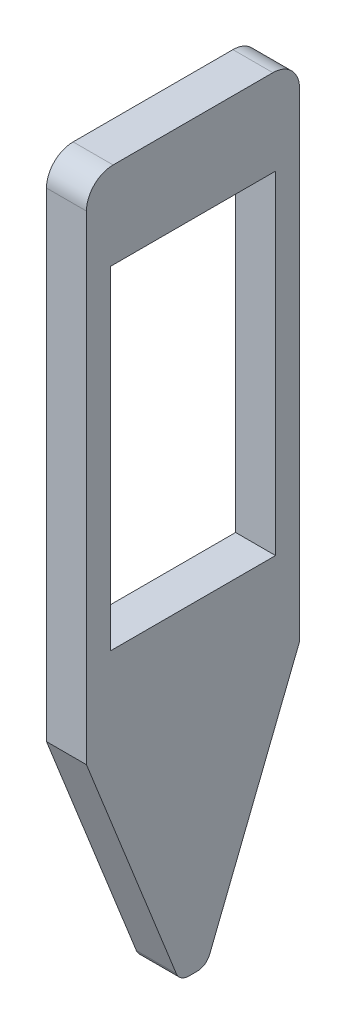
ISO-10303-21;
HEADER;
FILE_DESCRIPTION(('STEP AP214'),'2;1');
FILE_NAME('part.step','',(''),(''),'','','');
FILE_SCHEMA(('AUTOMOTIVE_DESIGN { 1 0 10303 214 1 1 1 1 }'));
ENDSEC;
DATA;
#1=APPLICATION_CONTEXT('core data for automotive mechanical design processes');
#2=APPLICATION_PROTOCOL_DEFINITION('international standard','automotive_design',2000,#1);
#3=PRODUCT_CONTEXT('',#1,'mechanical');
#4=PRODUCT('Part','Part','',(#3));
#5=PRODUCT_RELATED_PRODUCT_CATEGORY('part','',(#4));
#6=PRODUCT_DEFINITION_FORMATION('','',#4);
#7=PRODUCT_DEFINITION_CONTEXT('part definition',#1,'design');
#8=PRODUCT_DEFINITION('design','',#6,#7);
#9=PRODUCT_DEFINITION_SHAPE('','',#8);
#10=(LENGTH_UNIT() NAMED_UNIT(*) SI_UNIT(.MILLI.,.METRE.));
#11=(NAMED_UNIT(*) PLANE_ANGLE_UNIT() SI_UNIT($,.RADIAN.));
#12=(NAMED_UNIT(*) SI_UNIT($,.STERADIAN.) SOLID_ANGLE_UNIT());
#13=UNCERTAINTY_MEASURE_WITH_UNIT(LENGTH_MEASURE(1.E-05),#10,'distance_accuracy_value','');
#14=(GEOMETRIC_REPRESENTATION_CONTEXT(3) GLOBAL_UNCERTAINTY_ASSIGNED_CONTEXT((#13)) GLOBAL_UNIT_ASSIGNED_CONTEXT((#10,
#11,#12)) REPRESENTATION_CONTEXT('',''));
#15=CARTESIAN_POINT('',(0.,0.,0.));
#16=DIRECTION('',(0.,0.,1.));
#17=DIRECTION('',(1.,0.,0.));
#18=AXIS2_PLACEMENT_3D('',#15,#16,#17);
#19=CARTESIAN_POINT('',(3.,-35.5938181351517,0.321624405634838));
#20=DIRECTION('',(-1.,0.,0.));
#21=DIRECTION('',(0.,0.,1.));
#22=AXIS2_PLACEMENT_3D('',#19,#20,#21);
#23=PLANE('',#22);
#24=DIRECTION('',(0.,0.,1.));
#25=VECTOR('',#24,1.);
#26=CARTESIAN_POINT('',(3.,19.,8.));
#27=LINE('',#26,#25);
#28=CARTESIAN_POINT('',(3.,19.,-6.));
#29=VERTEX_POINT('',#28);
#30=CARTESIAN_POINT('',(3.,19.,6.));
#31=VERTEX_POINT('',#30);
#32=EDGE_CURVE('E185',#29,#31,#27,.T.);
#33=ORIENTED_EDGE('',*,*,#32,.T.);
#34=CARTESIAN_POINT('',(3.,17.,6.));
#35=DIRECTION('',(-1.,0.,0.));
#36=DIRECTION('',(0.,0.,1.));
#37=AXIS2_PLACEMENT_3D('',#34,#35,#36);
#38=CIRCLE('',#37,2.);
#39=CARTESIAN_POINT('',(3.,17.,8.));
#40=VERTEX_POINT('',#39);
#41=EDGE_CURVE('E43',#31,#40,#38,.F.);
#42=ORIENTED_EDGE('',*,*,#41,.T.);
#43=DIRECTION('',(0.,-1.,0.));
#44=VECTOR('',#43,1.);
#45=CARTESIAN_POINT('',(3.,19.,8.));
#46=LINE('',#45,#44);
#47=CARTESIAN_POINT('',(3.,-19.,8.));
#48=VERTEX_POINT('',#47);
#49=EDGE_CURVE('E187',#40,#48,#46,.T.);
#50=ORIENTED_EDGE('',*,*,#49,.T.);
#51=DIRECTION('',(0.,-0.929158524502118,-0.369681533681419));
#52=VECTOR('',#51,1.);
#53=CARTESIAN_POINT('',(3.,-19.,8.));
#54=LINE('',#53,#52);
#55=CARTESIAN_POINT('',(3.,-35.9634996688331,1.25078293013696));
#56=VERTEX_POINT('',#55);
#57=EDGE_CURVE('E189',#48,#56,#54,.T.);
#58=ORIENTED_EDGE('',*,*,#57,.T.);
#59=CARTESIAN_POINT('',(3.,-35.5938181351517,0.321624405634838));
#60=DIRECTION('',(1.,0.,0.));
#61=DIRECTION('',(0.,0.,1.));
#62=AXIS2_PLACEMENT_3D('',#59,#60,#61);
#63=CIRCLE('',#62,1.);
#64=CARTESIAN_POINT('',(3.,-36.5938181351517,0.321624405634838));
#65=VERTEX_POINT('',#64);
#66=EDGE_CURVE('E191',#56,#65,#63,.T.);
#67=ORIENTED_EDGE('',*,*,#66,.T.);
#68=DIRECTION('',(0.,0.,-1.));
#69=VECTOR('',#68,1.);
#70=CARTESIAN_POINT('',(3.,-36.5938181351517,0.321624405634838));
#71=LINE('',#70,#69);
#72=CARTESIAN_POINT('',(3.,-36.5938181351517,-0.321624405634838));
#73=VERTEX_POINT('',#72);
#74=EDGE_CURVE('E193',#65,#73,#71,.T.);
#75=ORIENTED_EDGE('',*,*,#74,.T.);
#76=CARTESIAN_POINT('',(3.,-35.5938181351517,-0.321624405634838));
#77=DIRECTION('',(1.,0.,0.));
#78=DIRECTION('',(0.,0.,1.));
#79=AXIS2_PLACEMENT_3D('',#76,#77,#78);
#80=CIRCLE('',#79,1.);
#81=CARTESIAN_POINT('',(3.,-35.9634996688331,-1.25078293013696));
#82=VERTEX_POINT('',#81);
#83=EDGE_CURVE('E195',#73,#82,#80,.T.);
#84=ORIENTED_EDGE('',*,*,#83,.T.);
#85=DIRECTION('',(0.,0.929158524502118,-0.369681533681419));
#86=VECTOR('',#85,1.);
#87=CARTESIAN_POINT('',(3.,-35.9634996688331,-1.25078293013696));
#88=LINE('',#87,#86);
#89=CARTESIAN_POINT('',(3.,-19.,-8.));
#90=VERTEX_POINT('',#89);
#91=EDGE_CURVE('E179',#82,#90,#88,.T.);
#92=ORIENTED_EDGE('',*,*,#91,.T.);
#93=DIRECTION('',(0.,1.,0.));
#94=VECTOR('',#93,1.);
#95=CARTESIAN_POINT('',(3.,19.,-8.));
#96=LINE('',#95,#94);
#97=CARTESIAN_POINT('',(3.,17.,-8.));
#98=VERTEX_POINT('',#97);
#99=EDGE_CURVE('E182',#90,#98,#96,.T.);
#100=ORIENTED_EDGE('',*,*,#99,.T.);
#101=CARTESIAN_POINT('',(3.,17.,-6.));
#102=DIRECTION('',(-1.,0.,0.));
#103=DIRECTION('',(0.,0.,1.));
#104=AXIS2_PLACEMENT_3D('',#101,#102,#103);
#105=CIRCLE('',#104,2.);
#106=EDGE_CURVE('E241',#98,#29,#105,.F.);
#107=ORIENTED_EDGE('',*,*,#106,.T.);
#108=EDGE_LOOP('',(#33,#42,#50,#58,#67,#75,#84,#92,#100,#107));
#109=FACE_BOUND('',#108,.T.);
#110=DIRECTION('',(0.,1.,0.));
#111=VECTOR('',#110,1.);
#112=CARTESIAN_POINT('',(3.,12.5,-6.2));
#113=LINE('',#112,#111);
#114=CARTESIAN_POINT('',(3.,-12.5,-6.2));
#115=VERTEX_POINT('',#114);
#116=CARTESIAN_POINT('',(3.,12.5,-6.2));
#117=VERTEX_POINT('',#116);
#118=EDGE_CURVE('E138',#115,#117,#113,.T.);
#119=ORIENTED_EDGE('',*,*,#118,.F.);
#120=DIRECTION('',(0.,0.,-1.));
#121=VECTOR('',#120,1.);
#122=CARTESIAN_POINT('',(3.,-12.5,6.2));
#123=LINE('',#122,#121);
#124=CARTESIAN_POINT('',(3.,-12.5,6.2));
#125=VERTEX_POINT('',#124);
#126=EDGE_CURVE('E163',#125,#115,#123,.T.);
#127=ORIENTED_EDGE('',*,*,#126,.F.);
#128=DIRECTION('',(0.,-1.,0.));
#129=VECTOR('',#128,1.);
#130=CARTESIAN_POINT('',(3.,12.5,6.2));
#131=LINE('',#130,#129);
#132=CARTESIAN_POINT('',(3.,12.5,6.2));
#133=VERTEX_POINT('',#132);
#134=EDGE_CURVE('E161',#133,#125,#131,.T.);
#135=ORIENTED_EDGE('',*,*,#134,.F.);
#136=DIRECTION('',(0.,0.,1.));
#137=VECTOR('',#136,1.);
#138=CARTESIAN_POINT('',(3.,12.5,6.2));
#139=LINE('',#138,#137);
#140=EDGE_CURVE('E148',#117,#133,#139,.T.);
#141=ORIENTED_EDGE('',*,*,#140,.F.);
#142=EDGE_LOOP('',(#119,#127,#135,#141));
#143=FACE_BOUND('',#142,.T.);
#144=ADVANCED_FACE('F35',(#109,#143),#23,.F.);
#145=CARTESIAN_POINT('',(0.,-35.5938181351517,0.321624405634838));
#146=DIRECTION('',(-1.,0.,0.));
#147=DIRECTION('',(0.,0.,1.));
#148=AXIS2_PLACEMENT_3D('',#145,#146,#147);
#149=PLANE('',#148);
#150=DIRECTION('',(0.,-1.,0.));
#151=VECTOR('',#150,1.);
#152=CARTESIAN_POINT('',(0.,19.,8.));
#153=LINE('',#152,#151);
#154=CARTESIAN_POINT('',(0.,17.,8.));
#155=VERTEX_POINT('',#154);
#156=CARTESIAN_POINT('',(0.,-19.,8.));
#157=VERTEX_POINT('',#156);
#158=EDGE_CURVE('E204',#155,#157,#153,.T.);
#159=ORIENTED_EDGE('',*,*,#158,.F.);
#160=CARTESIAN_POINT('',(0.,17.,6.));
#161=DIRECTION('',(-1.,0.,0.));
#162=DIRECTION('',(0.,0.,1.));
#163=AXIS2_PLACEMENT_3D('',#160,#161,#162);
#164=CIRCLE('',#163,2.);
#165=CARTESIAN_POINT('',(0.,19.,6.));
#166=VERTEX_POINT('',#165);
#167=EDGE_CURVE('E235',#155,#166,#164,.T.);
#168=ORIENTED_EDGE('',*,*,#167,.T.);
#169=DIRECTION('',(0.,0.,1.));
#170=VECTOR('',#169,1.);
#171=CARTESIAN_POINT('',(0.,19.,8.));
#172=LINE('',#171,#170);
#173=CARTESIAN_POINT('',(0.,19.,-6.));
#174=VERTEX_POINT('',#173);
#175=EDGE_CURVE('E202',#174,#166,#172,.T.);
#176=ORIENTED_EDGE('',*,*,#175,.F.);
#177=CARTESIAN_POINT('',(0.,17.,-6.));
#178=DIRECTION('',(-1.,0.,0.));
#179=DIRECTION('',(0.,0.,1.));
#180=AXIS2_PLACEMENT_3D('',#177,#178,#179);
#181=CIRCLE('',#180,2.);
#182=CARTESIAN_POINT('',(0.,17.,-8.));
#183=VERTEX_POINT('',#182);
#184=EDGE_CURVE('E233',#174,#183,#181,.T.);
#185=ORIENTED_EDGE('',*,*,#184,.T.);
#186=DIRECTION('',(0.,1.,0.));
#187=VECTOR('',#186,1.);
#188=CARTESIAN_POINT('',(0.,19.,-8.));
#189=LINE('',#188,#187);
#190=CARTESIAN_POINT('',(0.,-19.,-8.));
#191=VERTEX_POINT('',#190);
#192=EDGE_CURVE('E200',#191,#183,#189,.T.);
#193=ORIENTED_EDGE('',*,*,#192,.F.);
#194=DIRECTION('',(0.,0.929158524502118,-0.369681533681419));
#195=VECTOR('',#194,1.);
#196=CARTESIAN_POINT('',(0.,-35.9634996688331,-1.25078293013696));
#197=LINE('',#196,#195);
#198=CARTESIAN_POINT('',(0.,-35.9634996688331,-1.25078293013696));
#199=VERTEX_POINT('',#198);
#200=EDGE_CURVE('E156',#199,#191,#197,.T.);
#201=ORIENTED_EDGE('',*,*,#200,.F.);
#202=CARTESIAN_POINT('',(0.,-35.5938181351517,-0.321624405634838));
#203=DIRECTION('',(1.,0.,0.));
#204=DIRECTION('',(0.,0.,1.));
#205=AXIS2_PLACEMENT_3D('',#202,#203,#204);
#206=CIRCLE('',#205,1.);
#207=CARTESIAN_POINT('',(0.,-36.5938181351517,-0.321624405634838));
#208=VERTEX_POINT('',#207);
#209=EDGE_CURVE('E183',#208,#199,#206,.T.);
#210=ORIENTED_EDGE('',*,*,#209,.F.);
#211=DIRECTION('',(0.,0.,-1.));
#212=VECTOR('',#211,1.);
#213=CARTESIAN_POINT('',(0.,-36.5938181351517,0.321624405634838));
#214=LINE('',#213,#212);
#215=CARTESIAN_POINT('',(0.,-36.5938181351517,0.321624405634838));
#216=VERTEX_POINT('',#215);
#217=EDGE_CURVE('E210',#216,#208,#214,.T.);
#218=ORIENTED_EDGE('',*,*,#217,.F.);
#219=CARTESIAN_POINT('',(0.,-35.5938181351517,0.321624405634838));
#220=DIRECTION('',(1.,0.,0.));
#221=DIRECTION('',(0.,0.,1.));
#222=AXIS2_PLACEMENT_3D('',#219,#220,#221);
#223=CIRCLE('',#222,1.);
#224=CARTESIAN_POINT('',(0.,-35.9634996688331,1.25078293013696));
#225=VERTEX_POINT('',#224);
#226=EDGE_CURVE('E208',#225,#216,#223,.T.);
#227=ORIENTED_EDGE('',*,*,#226,.F.);
#228=DIRECTION('',(0.,-0.929158524502118,-0.369681533681419));
#229=VECTOR('',#228,1.);
#230=CARTESIAN_POINT('',(0.,-19.,8.));
#231=LINE('',#230,#229);
#232=EDGE_CURVE('E206',#157,#225,#231,.T.);
#233=ORIENTED_EDGE('',*,*,#232,.F.);
#234=EDGE_LOOP('',(#159,#168,#176,#185,#193,#201,#210,#218,#227,#233));
#235=FACE_BOUND('',#234,.T.);
#236=DIRECTION('',(0.,0.,-1.));
#237=VECTOR('',#236,1.);
#238=CARTESIAN_POINT('',(0.,-12.5,6.2));
#239=LINE('',#238,#237);
#240=CARTESIAN_POINT('',(0.,-12.5,6.2));
#241=VERTEX_POINT('',#240);
#242=CARTESIAN_POINT('',(0.,-12.5,-6.2));
#243=VERTEX_POINT('',#242);
#244=EDGE_CURVE('E149',#241,#243,#239,.T.);
#245=ORIENTED_EDGE('',*,*,#244,.T.);
#246=DIRECTION('',(0.,1.,0.));
#247=VECTOR('',#246,1.);
#248=CARTESIAN_POINT('',(0.,12.5,-6.2));
#249=LINE('',#248,#247);
#250=CARTESIAN_POINT('',(0.,12.5,-6.2));
#251=VERTEX_POINT('',#250);
#252=EDGE_CURVE('E167',#243,#251,#249,.T.);
#253=ORIENTED_EDGE('',*,*,#252,.T.);
#254=DIRECTION('',(0.,0.,1.));
#255=VECTOR('',#254,1.);
#256=CARTESIAN_POINT('',(0.,12.5,6.2));
#257=LINE('',#256,#255);
#258=CARTESIAN_POINT('',(0.,12.5,6.2));
#259=VERTEX_POINT('',#258);
#260=EDGE_CURVE('E155',#251,#259,#257,.T.);
#261=ORIENTED_EDGE('',*,*,#260,.T.);
#262=DIRECTION('',(0.,-1.,0.));
#263=VECTOR('',#262,1.);
#264=CARTESIAN_POINT('',(0.,12.5,6.2));
#265=LINE('',#264,#263);
#266=EDGE_CURVE('E170',#259,#241,#265,.T.);
#267=ORIENTED_EDGE('',*,*,#266,.T.);
#268=EDGE_LOOP('',(#245,#253,#261,#267));
#269=FACE_BOUND('',#268,.T.);
#270=ADVANCED_FACE('F255',(#235,#269),#149,.T.);
#271=CARTESIAN_POINT('',(3.,-35.9634996688331,-1.25078293013696));
#272=DIRECTION('',(0.,0.369681533681419,0.929158524502118));
#273=DIRECTION('',(0.,-0.929158524502119,0.369681533681419));
#274=AXIS2_PLACEMENT_3D('',#271,#272,#273);
#275=PLANE('',#274);
#276=ORIENTED_EDGE('',*,*,#200,.T.);
#277=DIRECTION('',(-1.,0.,0.));
#278=VECTOR('',#277,1.);
#279=CARTESIAN_POINT('',(3.,-19.,-8.));
#280=LINE('',#279,#278);
#281=EDGE_CURVE('E227',#90,#191,#280,.T.);
#282=ORIENTED_EDGE('',*,*,#281,.F.);
#283=ORIENTED_EDGE('',*,*,#91,.F.);
#284=DIRECTION('',(-1.,0.,0.));
#285=VECTOR('',#284,1.);
#286=CARTESIAN_POINT('',(3.,-35.9634996688331,-1.25078293013696));
#287=LINE('',#286,#285);
#288=EDGE_CURVE('E197',#82,#199,#287,.T.);
#289=ORIENTED_EDGE('',*,*,#288,.T.);
#290=EDGE_LOOP('',(#276,#282,#283,#289));
#291=FACE_BOUND('',#290,.T.);
#292=ADVANCED_FACE('F267',(#291),#275,.F.);
#293=CARTESIAN_POINT('',(3.,19.,-8.));
#294=DIRECTION('',(0.,0.,1.));
#295=DIRECTION('',(1.,0.,0.));
#296=AXIS2_PLACEMENT_3D('',#293,#294,#295);
#297=PLANE('',#296);
#298=ORIENTED_EDGE('',*,*,#192,.T.);
#299=DIRECTION('',(-1.,0.,0.));
#300=VECTOR('',#299,1.);
#301=CARTESIAN_POINT('',(3.,17.,-8.));
#302=LINE('',#301,#300);
#303=EDGE_CURVE('E11',#183,#98,#302,.F.);
#304=ORIENTED_EDGE('',*,*,#303,.T.);
#305=ORIENTED_EDGE('',*,*,#99,.F.);
#306=ORIENTED_EDGE('',*,*,#281,.T.);
#307=EDGE_LOOP('',(#298,#304,#305,#306));
#308=FACE_BOUND('',#307,.T.);
#309=ADVANCED_FACE('F263',(#308),#297,.F.);
#310=CARTESIAN_POINT('',(3.,19.,8.));
#311=DIRECTION('',(0.,-1.,0.));
#312=DIRECTION('',(0.,0.,-1.));
#313=AXIS2_PLACEMENT_3D('',#310,#311,#312);
#314=PLANE('',#313);
#315=ORIENTED_EDGE('',*,*,#175,.T.);
#316=DIRECTION('',(-1.,0.,0.));
#317=VECTOR('',#316,1.);
#318=CARTESIAN_POINT('',(3.,19.,6.));
#319=LINE('',#318,#317);
#320=EDGE_CURVE('E56',#166,#31,#319,.F.);
#321=ORIENTED_EDGE('',*,*,#320,.T.);
#322=ORIENTED_EDGE('',*,*,#32,.F.);
#323=DIRECTION('',(-1.,0.,0.));
#324=VECTOR('',#323,1.);
#325=CARTESIAN_POINT('',(3.,19.,-6.));
#326=LINE('',#325,#324);
#327=EDGE_CURVE('E237',#29,#174,#326,.T.);
#328=ORIENTED_EDGE('',*,*,#327,.T.);
#329=EDGE_LOOP('',(#315,#321,#322,#328));
#330=FACE_BOUND('',#329,.T.);
#331=ADVANCED_FACE('F258',(#330),#314,.F.);
#332=CARTESIAN_POINT('',(3.,19.,8.));
#333=DIRECTION('',(0.,0.,-1.));
#334=DIRECTION('',(-1.,0.,0.));
#335=AXIS2_PLACEMENT_3D('',#332,#333,#334);
#336=PLANE('',#335);
#337=ORIENTED_EDGE('',*,*,#49,.F.);
#338=DIRECTION('',(-1.,0.,0.));
#339=VECTOR('',#338,1.);
#340=CARTESIAN_POINT('',(3.,17.,8.));
#341=LINE('',#340,#339);
#342=EDGE_CURVE('E230',#40,#155,#341,.T.);
#343=ORIENTED_EDGE('',*,*,#342,.T.);
#344=ORIENTED_EDGE('',*,*,#158,.T.);
#345=DIRECTION('',(-1.,0.,0.));
#346=VECTOR('',#345,1.);
#347=CARTESIAN_POINT('',(3.,-19.,8.));
#348=LINE('',#347,#346);
#349=EDGE_CURVE('E224',#48,#157,#348,.T.);
#350=ORIENTED_EDGE('',*,*,#349,.F.);
#351=EDGE_LOOP('',(#337,#343,#344,#350));
#352=FACE_BOUND('',#351,.T.);
#353=ADVANCED_FACE('F249',(#352),#336,.F.);
#354=CARTESIAN_POINT('',(3.,-19.,8.));
#355=DIRECTION('',(0.,0.369681533681419,-0.929158524502118));
#356=DIRECTION('',(0.,0.929158524502119,0.369681533681419));
#357=AXIS2_PLACEMENT_3D('',#354,#355,#356);
#358=PLANE('',#357);
#359=ORIENTED_EDGE('',*,*,#232,.T.);
#360=DIRECTION('',(-1.,0.,0.));
#361=VECTOR('',#360,1.);
#362=CARTESIAN_POINT('',(3.,-35.9634996688331,1.25078293013696));
#363=LINE('',#362,#361);
#364=EDGE_CURVE('E221',#56,#225,#363,.T.);
#365=ORIENTED_EDGE('',*,*,#364,.F.);
#366=ORIENTED_EDGE('',*,*,#57,.F.);
#367=ORIENTED_EDGE('',*,*,#349,.T.);
#368=EDGE_LOOP('',(#359,#365,#366,#367));
#369=FACE_BOUND('',#368,.T.);
#370=ADVANCED_FACE('F285',(#369),#358,.F.);
#371=CARTESIAN_POINT('',(3.,-35.5938181351517,0.321624405634838));
#372=DIRECTION('',(-1.,0.,0.));
#373=DIRECTION('',(0.,0.,1.));
#374=AXIS2_PLACEMENT_3D('',#371,#372,#373);
#375=CYLINDRICAL_SURFACE('',#374,1.);
#376=ORIENTED_EDGE('',*,*,#226,.T.);
#377=DIRECTION('',(-1.,0.,0.));
#378=VECTOR('',#377,1.);
#379=CARTESIAN_POINT('',(3.,-36.5938181351517,0.321624405634838));
#380=LINE('',#379,#378);
#381=EDGE_CURVE('E218',#65,#216,#380,.T.);
#382=ORIENTED_EDGE('',*,*,#381,.F.);
#383=ORIENTED_EDGE('',*,*,#66,.F.);
#384=ORIENTED_EDGE('',*,*,#364,.T.);
#385=EDGE_LOOP('',(#376,#382,#383,#384));
#386=FACE_BOUND('',#385,.T.);
#387=ADVANCED_FACE('F282',(#386),#375,.T.);
#388=CARTESIAN_POINT('',(3.,-36.5938181351517,0.321624405634838));
#389=DIRECTION('',(0.,1.,0.));
#390=DIRECTION('',(0.,0.,1.));
#391=AXIS2_PLACEMENT_3D('',#388,#389,#390);
#392=PLANE('',#391);
#393=ORIENTED_EDGE('',*,*,#217,.T.);
#394=DIRECTION('',(-1.,0.,0.));
#395=VECTOR('',#394,1.);
#396=CARTESIAN_POINT('',(3.,-36.5938181351517,-0.321624405634838));
#397=LINE('',#396,#395);
#398=EDGE_CURVE('E215',#73,#208,#397,.T.);
#399=ORIENTED_EDGE('',*,*,#398,.F.);
#400=ORIENTED_EDGE('',*,*,#74,.F.);
#401=ORIENTED_EDGE('',*,*,#381,.T.);
#402=EDGE_LOOP('',(#393,#399,#400,#401));
#403=FACE_BOUND('',#402,.T.);
#404=ADVANCED_FACE('F278',(#403),#392,.F.);
#405=CARTESIAN_POINT('',(3.,-35.5938181351517,-0.321624405634838));
#406=DIRECTION('',(-1.,0.,0.));
#407=DIRECTION('',(0.,0.,1.));
#408=AXIS2_PLACEMENT_3D('',#405,#406,#407);
#409=CYLINDRICAL_SURFACE('',#408,1.);
#410=ORIENTED_EDGE('',*,*,#209,.T.);
#411=ORIENTED_EDGE('',*,*,#288,.F.);
#412=ORIENTED_EDGE('',*,*,#83,.F.);
#413=ORIENTED_EDGE('',*,*,#398,.T.);
#414=EDGE_LOOP('',(#410,#411,#412,#413));
#415=FACE_BOUND('',#414,.T.);
#416=ADVANCED_FACE('F273',(#415),#409,.T.);
#417=CARTESIAN_POINT('',(3.,12.5,-6.2));
#418=DIRECTION('',(0.,0.,1.));
#419=DIRECTION('',(1.,0.,0.));
#420=AXIS2_PLACEMENT_3D('',#417,#418,#419);
#421=PLANE('',#420);
#422=ORIENTED_EDGE('',*,*,#252,.F.);
#423=DIRECTION('',(-1.,0.,0.));
#424=VECTOR('',#423,1.);
#425=CARTESIAN_POINT('',(3.,-12.5,-6.2));
#426=LINE('',#425,#424);
#427=EDGE_CURVE('E144',#115,#243,#426,.T.);
#428=ORIENTED_EDGE('',*,*,#427,.F.);
#429=ORIENTED_EDGE('',*,*,#118,.T.);
#430=DIRECTION('',(-1.,0.,0.));
#431=VECTOR('',#430,1.);
#432=CARTESIAN_POINT('',(3.,12.5,-6.2));
#433=LINE('',#432,#431);
#434=EDGE_CURVE('E141',#117,#251,#433,.T.);
#435=ORIENTED_EDGE('',*,*,#434,.T.);
#436=EDGE_LOOP('',(#422,#428,#429,#435));
#437=FACE_BOUND('',#436,.T.);
#438=ADVANCED_FACE('F140',(#437),#421,.T.);
#439=CARTESIAN_POINT('',(3.,12.5,6.2));
#440=DIRECTION('',(0.,-1.,0.));
#441=DIRECTION('',(0.,0.,-1.));
#442=AXIS2_PLACEMENT_3D('',#439,#440,#441);
#443=PLANE('',#442);
#444=ORIENTED_EDGE('',*,*,#260,.F.);
#445=ORIENTED_EDGE('',*,*,#434,.F.);
#446=ORIENTED_EDGE('',*,*,#140,.T.);
#447=DIRECTION('',(-1.,0.,0.));
#448=VECTOR('',#447,1.);
#449=CARTESIAN_POINT('',(3.,12.5,6.2));
#450=LINE('',#449,#448);
#451=EDGE_CURVE('E157',#133,#259,#450,.T.);
#452=ORIENTED_EDGE('',*,*,#451,.T.);
#453=EDGE_LOOP('',(#444,#445,#446,#452));
#454=FACE_BOUND('',#453,.T.);
#455=ADVANCED_FACE('F152',(#454),#443,.T.);
#456=CARTESIAN_POINT('',(3.,12.5,6.2));
#457=DIRECTION('',(0.,0.,-1.));
#458=DIRECTION('',(-1.,0.,0.));
#459=AXIS2_PLACEMENT_3D('',#456,#457,#458);
#460=PLANE('',#459);
#461=ORIENTED_EDGE('',*,*,#266,.F.);
#462=ORIENTED_EDGE('',*,*,#451,.F.);
#463=ORIENTED_EDGE('',*,*,#134,.T.);
#464=DIRECTION('',(-1.,0.,0.));
#465=VECTOR('',#464,1.);
#466=CARTESIAN_POINT('',(3.,-12.5,6.2));
#467=LINE('',#466,#465);
#468=EDGE_CURVE('E176',#125,#241,#467,.T.);
#469=ORIENTED_EDGE('',*,*,#468,.T.);
#470=EDGE_LOOP('',(#461,#462,#463,#469));
#471=FACE_BOUND('',#470,.T.);
#472=ADVANCED_FACE('F325',(#471),#460,.T.);
#473=CARTESIAN_POINT('',(3.,-12.5,6.2));
#474=DIRECTION('',(0.,1.,0.));
#475=DIRECTION('',(0.,0.,1.));
#476=AXIS2_PLACEMENT_3D('',#473,#474,#475);
#477=PLANE('',#476);
#478=ORIENTED_EDGE('',*,*,#244,.F.);
#479=ORIENTED_EDGE('',*,*,#468,.F.);
#480=ORIENTED_EDGE('',*,*,#126,.T.);
#481=ORIENTED_EDGE('',*,*,#427,.T.);
#482=EDGE_LOOP('',(#478,#479,#480,#481));
#483=FACE_BOUND('',#482,.T.);
#484=ADVANCED_FACE('F331',(#483),#477,.T.);
#485=CARTESIAN_POINT('',(3.,17.,6.));
#486=DIRECTION('',(-1.,0.,0.));
#487=DIRECTION('',(0.,0.,1.));
#488=AXIS2_PLACEMENT_3D('',#485,#486,#487);
#489=CYLINDRICAL_SURFACE('',#488,2.);
#490=ORIENTED_EDGE('',*,*,#41,.F.);
#491=ORIENTED_EDGE('',*,*,#320,.F.);
#492=ORIENTED_EDGE('',*,*,#167,.F.);
#493=ORIENTED_EDGE('',*,*,#342,.F.);
#494=EDGE_LOOP('',(#490,#491,#492,#493));
#495=FACE_BOUND('',#494,.T.);
#496=ADVANCED_FACE('F252',(#495),#489,.T.);
#497=CARTESIAN_POINT('',(3.,17.,-6.));
#498=DIRECTION('',(-1.,0.,0.));
#499=DIRECTION('',(0.,0.,1.));
#500=AXIS2_PLACEMENT_3D('',#497,#498,#499);
#501=CYLINDRICAL_SURFACE('',#500,2.);
#502=ORIENTED_EDGE('',*,*,#106,.F.);
#503=ORIENTED_EDGE('',*,*,#303,.F.);
#504=ORIENTED_EDGE('',*,*,#184,.F.);
#505=ORIENTED_EDGE('',*,*,#327,.F.);
#506=EDGE_LOOP('',(#502,#503,#504,#505));
#507=FACE_BOUND('',#506,.T.);
#508=ADVANCED_FACE('F37',(#507),#501,.T.);
#509=CLOSED_SHELL('',(#144,#270,#292,#309,#331,#353,#370,#387,#404,#416,#438,#455,#472,#484,
#496,#508));
#510=MANIFOLD_SOLID_BREP('B2',#509);
#511=ADVANCED_BREP_SHAPE_REPRESENTATION('',(#18,#510),#14);
#512=SHAPE_DEFINITION_REPRESENTATION(#9,#511);
ENDSEC;
END-ISO-10303-21;
